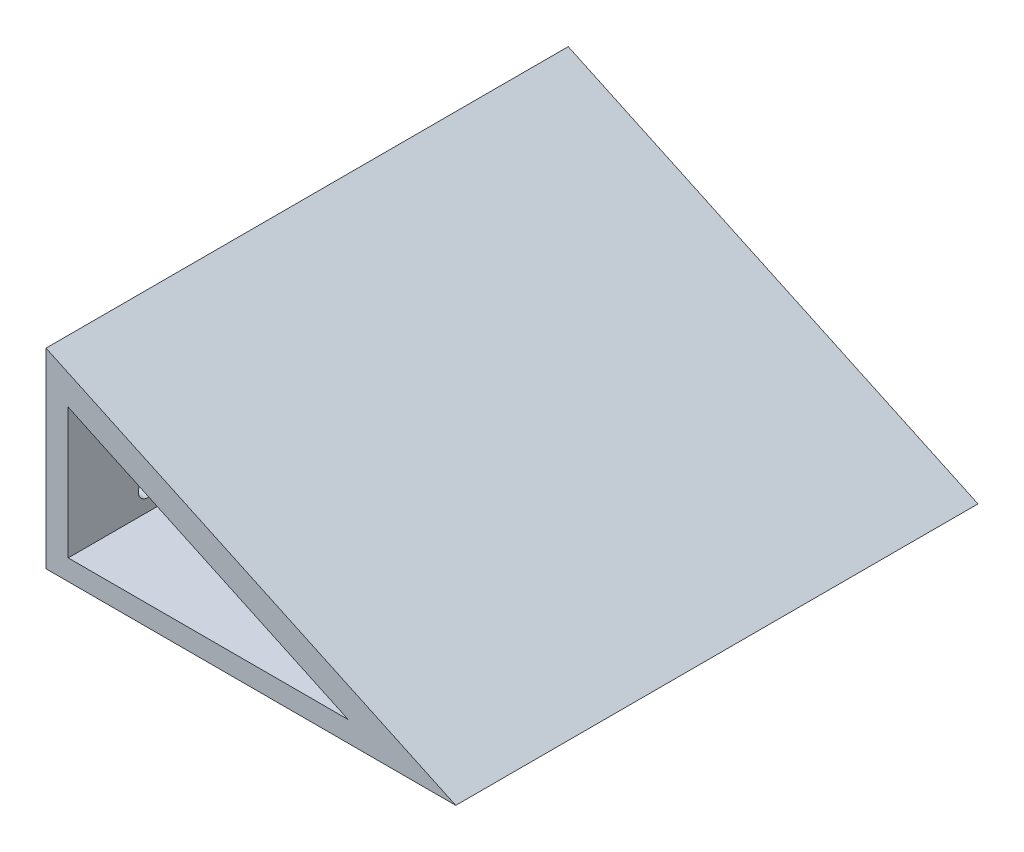
ISO-10303-21;
HEADER;
FILE_DESCRIPTION(('STEP AP214'),'2;1');
FILE_NAME('part.step','',(''),(''),'','','');
FILE_SCHEMA(('AUTOMOTIVE_DESIGN { 1 0 10303 214 1 1 1 1 }'));
ENDSEC;
DATA;
#1=APPLICATION_CONTEXT('core data for automotive mechanical design processes');
#2=APPLICATION_PROTOCOL_DEFINITION('international standard','automotive_design',2000,#1);
#3=PRODUCT_CONTEXT('',#1,'mechanical');
#4=PRODUCT('Part','Part','',(#3));
#5=PRODUCT_RELATED_PRODUCT_CATEGORY('part','',(#4));
#6=PRODUCT_DEFINITION_FORMATION('','',#4);
#7=PRODUCT_DEFINITION_CONTEXT('part definition',#1,'design');
#8=PRODUCT_DEFINITION('design','',#6,#7);
#9=PRODUCT_DEFINITION_SHAPE('','',#8);
#10=(LENGTH_UNIT() NAMED_UNIT(*) SI_UNIT(.MILLI.,.METRE.));
#11=(NAMED_UNIT(*) PLANE_ANGLE_UNIT() SI_UNIT($,.RADIAN.));
#12=(NAMED_UNIT(*) SI_UNIT($,.STERADIAN.) SOLID_ANGLE_UNIT());
#13=UNCERTAINTY_MEASURE_WITH_UNIT(LENGTH_MEASURE(1.E-05),#10,'distance_accuracy_value','');
#14=(GEOMETRIC_REPRESENTATION_CONTEXT(3) GLOBAL_UNCERTAINTY_ASSIGNED_CONTEXT((#13)) GLOBAL_UNIT_ASSIGNED_CONTEXT((#10,
#11,#12)) REPRESENTATION_CONTEXT('',''));
#15=CARTESIAN_POINT('',(0.,0.,0.));
#16=DIRECTION('',(0.,0.,1.));
#17=DIRECTION('',(1.,0.,0.));
#18=AXIS2_PLACEMENT_3D('',#15,#16,#17);
#19=CARTESIAN_POINT('',(-128.65,120.,163.95));
#20=DIRECTION('',(0.,0.,-1.));
#21=DIRECTION('',(-1.,0.,0.));
#22=AXIS2_PLACEMENT_3D('',#19,#20,#21);
#23=PLANE('',#22);
#24=DIRECTION('',(0.,-1.,0.));
#25=VECTOR('',#24,1.);
#26=CARTESIAN_POINT('',(-114.703132503749,94.8945372316401,163.95));
#27=LINE('',#26,#25);
#28=CARTESIAN_POINT('',(-114.703132503749,94.8945372316401,163.95));
#29=VERTEX_POINT('',#28);
#30=CARTESIAN_POINT('',(-114.703132503749,12.8945372316401,163.95));
#31=VERTEX_POINT('',#30);
#32=EDGE_CURVE('E102',#29,#31,#27,.T.);
#33=ORIENTED_EDGE('',*,*,#32,.F.);
#34=DIRECTION('',(-0.906262143569413,0.422716130675153,0.));
#35=VECTOR('',#34,1.);
#36=CARTESIAN_POINT('',(61.0968674962508,12.8945372316401,163.95));
#37=LINE('',#36,#35);
#38=CARTESIAN_POINT('',(61.0968674962508,12.8945372316401,163.95));
#39=VERTEX_POINT('',#38);
#40=EDGE_CURVE('E55',#39,#29,#37,.T.);
#41=ORIENTED_EDGE('',*,*,#40,.F.);
#42=DIRECTION('',(1.,0.,0.));
#43=VECTOR('',#42,1.);
#44=CARTESIAN_POINT('',(-114.703132503749,12.8945372316401,163.95));
#45=LINE('',#44,#43);
#46=EDGE_CURVE('E95',#31,#39,#45,.T.);
#47=ORIENTED_EDGE('',*,*,#46,.F.);
#48=EDGE_LOOP('',(#33,#41,#47));
#49=FACE_BOUND('',#48,.T.);
#50=DIRECTION('',(1.,0.,0.));
#51=VECTOR('',#50,1.);
#52=CARTESIAN_POINT('',(-128.65,0.,163.95));
#53=LINE('',#52,#51);
#54=CARTESIAN_POINT('',(-128.65,0.,163.95));
#55=VERTEX_POINT('',#54);
#56=CARTESIAN_POINT('',(128.65,0.,163.95));
#57=VERTEX_POINT('',#56);
#58=EDGE_CURVE('E116',#55,#57,#53,.T.);
#59=ORIENTED_EDGE('',*,*,#58,.T.);
#60=DIRECTION('',(0.906282098892965,-0.422673345772078,0.));
#61=VECTOR('',#60,1.);
#62=CARTESIAN_POINT('',(128.65,0.,163.95));
#63=LINE('',#62,#61);
#64=CARTESIAN_POINT('',(-128.65,120.,163.95));
#65=VERTEX_POINT('',#64);
#66=EDGE_CURVE('E111',#65,#57,#63,.T.);
#67=ORIENTED_EDGE('',*,*,#66,.F.);
#68=DIRECTION('',(0.,-1.,0.));
#69=VECTOR('',#68,1.);
#70=CARTESIAN_POINT('',(-128.65,120.,163.95));
#71=LINE('',#70,#69);
#72=EDGE_CURVE('E119',#65,#55,#71,.T.);
#73=ORIENTED_EDGE('',*,*,#72,.T.);
#74=EDGE_LOOP('',(#59,#67,#73));
#75=FACE_BOUND('',#74,.T.);
#76=ADVANCED_FACE('F39',(#49,#75),#23,.F.);
#77=CARTESIAN_POINT('',(-128.65,120.,-163.95));
#78=DIRECTION('',(0.,0.,-1.));
#79=DIRECTION('',(-1.,0.,0.));
#80=AXIS2_PLACEMENT_3D('',#77,#78,#79);
#81=PLANE('',#80);
#82=DIRECTION('',(0.906262143569413,-0.422716130675153,0.));
#83=VECTOR('',#82,1.);
#84=CARTESIAN_POINT('',(-135.775541781393,104.723533595501,-163.95));
#85=LINE('',#84,#83);
#86=CARTESIAN_POINT('',(-114.703132503749,94.8945372316401,-163.95));
#87=VERTEX_POINT('',#86);
#88=CARTESIAN_POINT('',(61.0968674962508,12.8945372316401,-163.95));
#89=VERTEX_POINT('',#88);
#90=EDGE_CURVE('E11',#87,#89,#85,.T.);
#91=ORIENTED_EDGE('',*,*,#90,.F.);
#92=DIRECTION('',(0.,1.,0.));
#93=VECTOR('',#92,1.);
#94=CARTESIAN_POINT('',(-114.703132503749,120.,-163.95));
#95=LINE('',#94,#93);
#96=CARTESIAN_POINT('',(-114.703132503749,12.8945372316401,-163.95));
#97=VERTEX_POINT('',#96);
#98=EDGE_CURVE('E134',#97,#87,#95,.T.);
#99=ORIENTED_EDGE('',*,*,#98,.F.);
#100=DIRECTION('',(-1.,0.,0.));
#101=VECTOR('',#100,1.);
#102=CARTESIAN_POINT('',(-128.65,12.8945372316401,-163.95));
#103=LINE('',#102,#101);
#104=EDGE_CURVE('E47',#89,#97,#103,.T.);
#105=ORIENTED_EDGE('',*,*,#104,.F.);
#106=EDGE_LOOP('',(#91,#99,#105));
#107=FACE_BOUND('',#106,.T.);
#108=DIRECTION('',(-0.906282098892965,0.422673345772078,0.));
#109=VECTOR('',#108,1.);
#110=CARTESIAN_POINT('',(-128.65,120.,-163.95));
#111=LINE('',#110,#109);
#112=CARTESIAN_POINT('',(128.65,0.,-163.95));
#113=VERTEX_POINT('',#112);
#114=CARTESIAN_POINT('',(-128.65,120.,-163.95));
#115=VERTEX_POINT('',#114);
#116=EDGE_CURVE('E114',#113,#115,#111,.T.);
#117=ORIENTED_EDGE('',*,*,#116,.F.);
#118=DIRECTION('',(1.,0.,0.));
#119=VECTOR('',#118,1.);
#120=CARTESIAN_POINT('',(-128.65,0.,-163.95));
#121=LINE('',#120,#119);
#122=CARTESIAN_POINT('',(-128.65,0.,-163.95));
#123=VERTEX_POINT('',#122);
#124=EDGE_CURVE('E126',#123,#113,#121,.T.);
#125=ORIENTED_EDGE('',*,*,#124,.F.);
#126=DIRECTION('',(0.,-1.,0.));
#127=VECTOR('',#126,1.);
#128=CARTESIAN_POINT('',(-128.65,120.,-163.95));
#129=LINE('',#128,#127);
#130=EDGE_CURVE('E132',#115,#123,#129,.T.);
#131=ORIENTED_EDGE('',*,*,#130,.F.);
#132=EDGE_LOOP('',(#117,#125,#131));
#133=FACE_BOUND('',#132,.T.);
#134=ADVANCED_FACE('F170',(#107,#133),#81,.T.);
#135=CARTESIAN_POINT('',(-128.65,120.,-163.95));
#136=DIRECTION('',(1.,0.,0.));
#137=DIRECTION('',(0.,0.,-1.));
#138=AXIS2_PLACEMENT_3D('',#135,#136,#137);
#139=PLANE('',#138);
#140=CARTESIAN_POINT('',(-128.65,26.7,-114.05));
#141=DIRECTION('',(-1.,0.,0.));
#142=DIRECTION('',(0.,0.,1.));
#143=AXIS2_PLACEMENT_3D('',#140,#141,#142);
#144=CIRCLE('',#143,6.);
#145=CARTESIAN_POINT('',(-128.65,26.7,-108.05));
#146=VERTEX_POINT('',#145);
#147=EDGE_CURVE('E153',#146,#146,#144,.T.);
#148=ORIENTED_EDGE('',*,*,#147,.F.);
#149=EDGE_LOOP('',(#148));
#150=FACE_BOUND('',#149,.T.);
#151=CARTESIAN_POINT('',(-128.65,80.,113.95));
#152=DIRECTION('',(-1.,0.,0.));
#153=DIRECTION('',(0.,0.,1.));
#154=AXIS2_PLACEMENT_3D('',#151,#152,#153);
#155=CIRCLE('',#154,6.00000000000002);
#156=CARTESIAN_POINT('',(-128.65,80.,119.95));
#157=VERTEX_POINT('',#156);
#158=EDGE_CURVE('E154',#157,#157,#155,.T.);
#159=ORIENTED_EDGE('',*,*,#158,.F.);
#160=EDGE_LOOP('',(#159));
#161=FACE_BOUND('',#160,.T.);
#162=CARTESIAN_POINT('',(-128.65,26.7,113.95));
#163=DIRECTION('',(-1.,0.,0.));
#164=DIRECTION('',(0.,0.,1.));
#165=AXIS2_PLACEMENT_3D('',#162,#163,#164);
#166=CIRCLE('',#165,6.);
#167=CARTESIAN_POINT('',(-128.65,26.7,119.95));
#168=VERTEX_POINT('',#167);
#169=EDGE_CURVE('E157',#168,#168,#166,.T.);
#170=ORIENTED_EDGE('',*,*,#169,.F.);
#171=EDGE_LOOP('',(#170));
#172=FACE_BOUND('',#171,.T.);
#173=CARTESIAN_POINT('',(-128.65,80.,-114.05));
#174=DIRECTION('',(-1.,0.,0.));
#175=DIRECTION('',(0.,0.,1.));
#176=AXIS2_PLACEMENT_3D('',#173,#174,#175);
#177=CIRCLE('',#176,6.);
#178=CARTESIAN_POINT('',(-128.65,80.,-108.05));
#179=VERTEX_POINT('',#178);
#180=EDGE_CURVE('E141',#179,#179,#177,.T.);
#181=ORIENTED_EDGE('',*,*,#180,.F.);
#182=EDGE_LOOP('',(#181));
#183=FACE_BOUND('',#182,.T.);
#184=DIRECTION('',(0.,0.,1.));
#185=VECTOR('',#184,1.);
#186=CARTESIAN_POINT('',(-128.65,0.,-163.95));
#187=LINE('',#186,#185);
#188=EDGE_CURVE('E120',#123,#55,#187,.T.);
#189=ORIENTED_EDGE('',*,*,#188,.T.);
#190=ORIENTED_EDGE('',*,*,#72,.F.);
#191=DIRECTION('',(0.,0.,1.));
#192=VECTOR('',#191,1.);
#193=CARTESIAN_POINT('',(-128.65,120.,-163.95));
#194=LINE('',#193,#192);
#195=EDGE_CURVE('E117',#115,#65,#194,.T.);
#196=ORIENTED_EDGE('',*,*,#195,.F.);
#197=ORIENTED_EDGE('',*,*,#130,.T.);
#198=EDGE_LOOP('',(#189,#190,#196,#197));
#199=FACE_BOUND('',#198,.T.);
#200=ADVANCED_FACE('F166',(#150,#161,#172,#183,#199),#139,.F.);
#201=CARTESIAN_POINT('',(0.,0.,0.));
#202=DIRECTION('',(0.,-1.,0.));
#203=DIRECTION('',(0.,0.,-1.));
#204=AXIS2_PLACEMENT_3D('',#201,#202,#203);
#205=PLANE('',#204);
#206=ORIENTED_EDGE('',*,*,#58,.F.);
#207=ORIENTED_EDGE('',*,*,#188,.F.);
#208=ORIENTED_EDGE('',*,*,#124,.T.);
#209=DIRECTION('',(0.,0.,1.));
#210=VECTOR('',#209,1.);
#211=CARTESIAN_POINT('',(128.65,0.,-163.95));
#212=LINE('',#211,#210);
#213=EDGE_CURVE('E123',#113,#57,#212,.T.);
#214=ORIENTED_EDGE('',*,*,#213,.T.);
#215=EDGE_LOOP('',(#206,#207,#208,#214));
#216=FACE_BOUND('',#215,.T.);
#217=ADVANCED_FACE('F169',(#216),#205,.T.);
#218=CARTESIAN_POINT('',(128.65,0.,-166.05));
#219=DIRECTION('',(-0.422673345772078,-0.906282098892965,0.));
#220=DIRECTION('',(0.906282098892965,-0.422673345772078,0.));
#221=AXIS2_PLACEMENT_3D('',#218,#219,#220);
#222=PLANE('',#221);
#223=ORIENTED_EDGE('',*,*,#116,.T.);
#224=ORIENTED_EDGE('',*,*,#195,.T.);
#225=ORIENTED_EDGE('',*,*,#66,.T.);
#226=ORIENTED_EDGE('',*,*,#213,.F.);
#227=EDGE_LOOP('',(#223,#224,#225,#226));
#228=FACE_BOUND('',#227,.T.);
#229=ADVANCED_FACE('F185',(#228),#222,.F.);
#230=CARTESIAN_POINT('',(61.0968674962508,12.8945372316401,-261.05));
#231=DIRECTION('',(0.422716130675153,0.906262143569413,0.));
#232=DIRECTION('',(-0.906262143569413,0.422716130675153,0.));
#233=AXIS2_PLACEMENT_3D('',#230,#231,#232);
#234=PLANE('',#233);
#235=ORIENTED_EDGE('',*,*,#90,.T.);
#236=DIRECTION('',(0.,0.,1.));
#237=VECTOR('',#236,1.);
#238=CARTESIAN_POINT('',(61.0968674962508,12.8945372316401,-261.05));
#239=LINE('',#238,#237);
#240=EDGE_CURVE('E98',#89,#39,#239,.T.);
#241=ORIENTED_EDGE('',*,*,#240,.T.);
#242=ORIENTED_EDGE('',*,*,#40,.T.);
#243=DIRECTION('',(0.,0.,1.));
#244=VECTOR('',#243,1.);
#245=CARTESIAN_POINT('',(-114.703132503749,94.8945372316401,-261.05));
#246=LINE('',#245,#244);
#247=EDGE_CURVE('E99',#87,#29,#246,.T.);
#248=ORIENTED_EDGE('',*,*,#247,.F.);
#249=EDGE_LOOP('',(#235,#241,#242,#248));
#250=FACE_BOUND('',#249,.T.);
#251=ADVANCED_FACE('F199',(#250),#234,.F.);
#252=CARTESIAN_POINT('',(-114.703132503749,12.8945372316401,-261.05));
#253=DIRECTION('',(0.,-1.,0.));
#254=DIRECTION('',(0.,0.,-1.));
#255=AXIS2_PLACEMENT_3D('',#252,#253,#254);
#256=PLANE('',#255);
#257=ORIENTED_EDGE('',*,*,#104,.T.);
#258=DIRECTION('',(0.,0.,1.));
#259=VECTOR('',#258,1.);
#260=CARTESIAN_POINT('',(-114.703132503749,12.8945372316401,-261.05));
#261=LINE('',#260,#259);
#262=EDGE_CURVE('E63',#97,#31,#261,.T.);
#263=ORIENTED_EDGE('',*,*,#262,.T.);
#264=ORIENTED_EDGE('',*,*,#46,.T.);
#265=ORIENTED_EDGE('',*,*,#240,.F.);
#266=EDGE_LOOP('',(#257,#263,#264,#265));
#267=FACE_BOUND('',#266,.T.);
#268=ADVANCED_FACE('F92',(#267),#256,.F.);
#269=CARTESIAN_POINT('',(-114.703132503749,94.8945372316401,-261.05));
#270=DIRECTION('',(-1.,0.,0.));
#271=DIRECTION('',(0.,0.,1.));
#272=AXIS2_PLACEMENT_3D('',#269,#270,#271);
#273=PLANE('',#272);
#274=CARTESIAN_POINT('',(-114.703132503749,26.7,-114.05));
#275=DIRECTION('',(-1.,0.,0.));
#276=DIRECTION('',(0.,0.,1.));
#277=AXIS2_PLACEMENT_3D('',#274,#275,#276);
#278=CIRCLE('',#277,6.);
#279=CARTESIAN_POINT('',(-114.703132503749,26.7,-108.05));
#280=VERTEX_POINT('',#279);
#281=EDGE_CURVE('E42',#280,#280,#278,.T.);
#282=ORIENTED_EDGE('',*,*,#281,.T.);
#283=EDGE_LOOP('',(#282));
#284=FACE_BOUND('',#283,.T.);
#285=CARTESIAN_POINT('',(-114.703132503749,80.,113.95));
#286=DIRECTION('',(-1.,0.,0.));
#287=DIRECTION('',(0.,0.,1.));
#288=AXIS2_PLACEMENT_3D('',#285,#286,#287);
#289=CIRCLE('',#288,6.00000000000002);
#290=CARTESIAN_POINT('',(-114.703132503749,80.,119.95));
#291=VERTEX_POINT('',#290);
#292=EDGE_CURVE('E143',#291,#291,#289,.T.);
#293=ORIENTED_EDGE('',*,*,#292,.T.);
#294=EDGE_LOOP('',(#293));
#295=FACE_BOUND('',#294,.T.);
#296=CARTESIAN_POINT('',(-114.703132503749,26.7,113.95));
#297=DIRECTION('',(-1.,0.,0.));
#298=DIRECTION('',(0.,0.,1.));
#299=AXIS2_PLACEMENT_3D('',#296,#297,#298);
#300=CIRCLE('',#299,6.);
#301=CARTESIAN_POINT('',(-114.703132503749,26.7,119.95));
#302=VERTEX_POINT('',#301);
#303=EDGE_CURVE('E140',#302,#302,#300,.T.);
#304=ORIENTED_EDGE('',*,*,#303,.T.);
#305=EDGE_LOOP('',(#304));
#306=FACE_BOUND('',#305,.T.);
#307=CARTESIAN_POINT('',(-114.703132503749,80.,-114.05));
#308=DIRECTION('',(-1.,0.,0.));
#309=DIRECTION('',(0.,0.,1.));
#310=AXIS2_PLACEMENT_3D('',#307,#308,#309);
#311=CIRCLE('',#310,6.);
#312=CARTESIAN_POINT('',(-114.703132503749,80.,-108.05));
#313=VERTEX_POINT('',#312);
#314=EDGE_CURVE('E137',#313,#313,#311,.T.);
#315=ORIENTED_EDGE('',*,*,#314,.T.);
#316=EDGE_LOOP('',(#315));
#317=FACE_BOUND('',#316,.T.);
#318=ORIENTED_EDGE('',*,*,#98,.T.);
#319=ORIENTED_EDGE('',*,*,#247,.T.);
#320=ORIENTED_EDGE('',*,*,#32,.T.);
#321=ORIENTED_EDGE('',*,*,#262,.F.);
#322=EDGE_LOOP('',(#318,#319,#320,#321));
#323=FACE_BOUND('',#322,.T.);
#324=ADVANCED_FACE('F103',(#284,#295,#306,#317,#323),#273,.F.);
#325=CARTESIAN_POINT('',(-107.65,80.,-114.05));
#326=DIRECTION('',(-1.,0.,0.));
#327=DIRECTION('',(0.,0.,1.));
#328=AXIS2_PLACEMENT_3D('',#325,#326,#327);
#329=CYLINDRICAL_SURFACE('',#328,6.);
#330=ORIENTED_EDGE('',*,*,#180,.T.);
#331=EDGE_LOOP('',(#330));
#332=FACE_BOUND('',#331,.T.);
#333=ORIENTED_EDGE('',*,*,#314,.F.);
#334=EDGE_LOOP('',(#333));
#335=FACE_BOUND('',#334,.T.);
#336=ADVANCED_FACE('F203',(#332,#335),#329,.F.);
#337=CARTESIAN_POINT('',(-107.65,26.7,113.95));
#338=DIRECTION('',(-1.,0.,0.));
#339=DIRECTION('',(0.,0.,1.));
#340=AXIS2_PLACEMENT_3D('',#337,#338,#339);
#341=CYLINDRICAL_SURFACE('',#340,6.);
#342=ORIENTED_EDGE('',*,*,#169,.T.);
#343=EDGE_LOOP('',(#342));
#344=FACE_BOUND('',#343,.T.);
#345=ORIENTED_EDGE('',*,*,#303,.F.);
#346=EDGE_LOOP('',(#345));
#347=FACE_BOUND('',#346,.T.);
#348=ADVANCED_FACE('F163',(#344,#347),#341,.F.);
#349=CARTESIAN_POINT('',(-107.65,80.,113.95));
#350=DIRECTION('',(-1.,0.,0.));
#351=DIRECTION('',(0.,0.,1.));
#352=AXIS2_PLACEMENT_3D('',#349,#350,#351);
#353=CYLINDRICAL_SURFACE('',#352,6.00000000000002);
#354=ORIENTED_EDGE('',*,*,#158,.T.);
#355=EDGE_LOOP('',(#354));
#356=FACE_BOUND('',#355,.T.);
#357=ORIENTED_EDGE('',*,*,#292,.F.);
#358=EDGE_LOOP('',(#357));
#359=FACE_BOUND('',#358,.T.);
#360=ADVANCED_FACE('F209',(#356,#359),#353,.F.);
#361=CARTESIAN_POINT('',(-107.65,26.7,-114.05));
#362=DIRECTION('',(-1.,0.,0.));
#363=DIRECTION('',(0.,0.,1.));
#364=AXIS2_PLACEMENT_3D('',#361,#362,#363);
#365=CYLINDRICAL_SURFACE('',#364,6.);
#366=ORIENTED_EDGE('',*,*,#147,.T.);
#367=EDGE_LOOP('',(#366));
#368=FACE_BOUND('',#367,.T.);
#369=ORIENTED_EDGE('',*,*,#281,.F.);
#370=EDGE_LOOP('',(#369));
#371=FACE_BOUND('',#370,.T.);
#372=ADVANCED_FACE('F212',(#368,#371),#365,.F.);
#373=CLOSED_SHELL('',(#76,#134,#200,#217,#229,#251,#268,#324,#336,#348,#360,#372));
#374=MANIFOLD_SOLID_BREP('B2',#373);
#375=ADVANCED_BREP_SHAPE_REPRESENTATION('',(#18,#374),#14);
#376=SHAPE_DEFINITION_REPRESENTATION(#9,#375);
ENDSEC;
END-ISO-10303-21;
